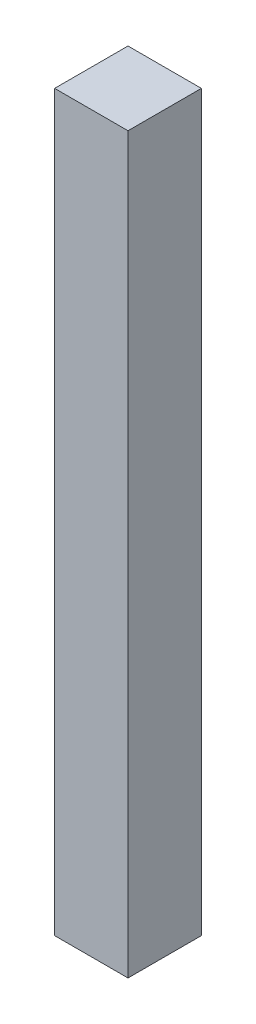
ISO-10303-21;
HEADER;
FILE_DESCRIPTION(('STEP AP214'),'2;1');
FILE_NAME('part.step','',(''),(''),'','','');
FILE_SCHEMA(('AUTOMOTIVE_DESIGN { 1 0 10303 214 1 1 1 1 }'));
ENDSEC;
DATA;
#1=APPLICATION_CONTEXT('core data for automotive mechanical design processes');
#2=APPLICATION_PROTOCOL_DEFINITION('international standard','automotive_design',2000,#1);
#3=PRODUCT_CONTEXT('',#1,'mechanical');
#4=PRODUCT('Part','Part','',(#3));
#5=PRODUCT_RELATED_PRODUCT_CATEGORY('part','',(#4));
#6=PRODUCT_DEFINITION_FORMATION('','',#4);
#7=PRODUCT_DEFINITION_CONTEXT('part definition',#1,'design');
#8=PRODUCT_DEFINITION('design','',#6,#7);
#9=PRODUCT_DEFINITION_SHAPE('','',#8);
#10=(LENGTH_UNIT() NAMED_UNIT(*) SI_UNIT(.MILLI.,.METRE.));
#11=(NAMED_UNIT(*) PLANE_ANGLE_UNIT() SI_UNIT($,.RADIAN.));
#12=(NAMED_UNIT(*) SI_UNIT($,.STERADIAN.) SOLID_ANGLE_UNIT());
#13=UNCERTAINTY_MEASURE_WITH_UNIT(LENGTH_MEASURE(1.E-05),#10,'distance_accuracy_value','');
#14=(GEOMETRIC_REPRESENTATION_CONTEXT(3) GLOBAL_UNCERTAINTY_ASSIGNED_CONTEXT((#13)) GLOBAL_UNIT_ASSIGNED_CONTEXT((#10,
#11,#12)) REPRESENTATION_CONTEXT('',''));
#15=CARTESIAN_POINT('',(0.,0.,0.));
#16=DIRECTION('',(0.,0.,1.));
#17=DIRECTION('',(1.,0.,0.));
#18=AXIS2_PLACEMENT_3D('',#15,#16,#17);
#19=CARTESIAN_POINT('',(3.175,63.5,3.175));
#20=DIRECTION('',(-1.,0.,0.));
#21=DIRECTION('',(0.,0.,1.));
#22=AXIS2_PLACEMENT_3D('',#19,#20,#21);
#23=PLANE('',#22);
#24=DIRECTION('',(0.,0.,-1.));
#25=VECTOR('',#24,1.);
#26=CARTESIAN_POINT('',(3.175,0.,3.175));
#27=LINE('',#26,#25);
#28=CARTESIAN_POINT('',(3.175,0.,3.175));
#29=VERTEX_POINT('',#28);
#30=CARTESIAN_POINT('',(3.175,0.,-3.175));
#31=VERTEX_POINT('',#30);
#32=EDGE_CURVE('E99',#29,#31,#27,.T.);
#33=ORIENTED_EDGE('',*,*,#32,.T.);
#34=DIRECTION('',(0.,-1.,0.));
#35=VECTOR('',#34,1.);
#36=CARTESIAN_POINT('',(3.175,63.5,-3.175));
#37=LINE('',#36,#35);
#38=CARTESIAN_POINT('',(3.175,63.5,-3.175));
#39=VERTEX_POINT('',#38);
#40=EDGE_CURVE('E11',#39,#31,#37,.T.);
#41=ORIENTED_EDGE('',*,*,#40,.F.);
#42=DIRECTION('',(0.,0.,-1.));
#43=VECTOR('',#42,1.);
#44=CARTESIAN_POINT('',(3.175,63.5,3.175));
#45=LINE('',#44,#43);
#46=CARTESIAN_POINT('',(3.175,63.5,3.175));
#47=VERTEX_POINT('',#46);
#48=EDGE_CURVE('E87',#47,#39,#45,.T.);
#49=ORIENTED_EDGE('',*,*,#48,.F.);
#50=DIRECTION('',(0.,-1.,0.));
#51=VECTOR('',#50,1.);
#52=CARTESIAN_POINT('',(3.175,63.5,3.175));
#53=LINE('',#52,#51);
#54=EDGE_CURVE('E95',#47,#29,#53,.T.);
#55=ORIENTED_EDGE('',*,*,#54,.T.);
#56=EDGE_LOOP('',(#33,#41,#49,#55));
#57=FACE_BOUND('',#56,.T.);
#58=ADVANCED_FACE('F36',(#57),#23,.F.);
#59=CARTESIAN_POINT('',(-3.175,63.5,-3.175));
#60=DIRECTION('',(0.,0.,1.));
#61=DIRECTION('',(1.,0.,0.));
#62=AXIS2_PLACEMENT_3D('',#59,#60,#61);
#63=PLANE('',#62);
#64=DIRECTION('',(-1.,0.,0.));
#65=VECTOR('',#64,1.);
#66=CARTESIAN_POINT('',(-3.175,0.,-3.175));
#67=LINE('',#66,#65);
#68=CARTESIAN_POINT('',(-3.175,0.,-3.175));
#69=VERTEX_POINT('',#68);
#70=EDGE_CURVE('E91',#31,#69,#67,.T.);
#71=ORIENTED_EDGE('',*,*,#70,.T.);
#72=DIRECTION('',(0.,-1.,0.));
#73=VECTOR('',#72,1.);
#74=CARTESIAN_POINT('',(-3.175,63.5,-3.175));
#75=LINE('',#74,#73);
#76=CARTESIAN_POINT('',(-3.175,63.5,-3.175));
#77=VERTEX_POINT('',#76);
#78=EDGE_CURVE('E44',#77,#69,#75,.T.);
#79=ORIENTED_EDGE('',*,*,#78,.F.);
#80=DIRECTION('',(-1.,0.,0.));
#81=VECTOR('',#80,1.);
#82=CARTESIAN_POINT('',(-3.175,63.5,-3.175));
#83=LINE('',#82,#81);
#84=EDGE_CURVE('E82',#39,#77,#83,.T.);
#85=ORIENTED_EDGE('',*,*,#84,.F.);
#86=ORIENTED_EDGE('',*,*,#40,.T.);
#87=EDGE_LOOP('',(#71,#79,#85,#86));
#88=FACE_BOUND('',#87,.T.);
#89=ADVANCED_FACE('F90',(#88),#63,.F.);
#90=CARTESIAN_POINT('',(-3.175,63.5,3.175));
#91=DIRECTION('',(1.,0.,0.));
#92=DIRECTION('',(0.,0.,-1.));
#93=AXIS2_PLACEMENT_3D('',#90,#91,#92);
#94=PLANE('',#93);
#95=DIRECTION('',(0.,0.,1.));
#96=VECTOR('',#95,1.);
#97=CARTESIAN_POINT('',(-3.175,0.,3.175));
#98=LINE('',#97,#96);
#99=CARTESIAN_POINT('',(-3.175,0.,3.175));
#100=VERTEX_POINT('',#99);
#101=EDGE_CURVE('E69',#69,#100,#98,.T.);
#102=ORIENTED_EDGE('',*,*,#101,.T.);
#103=DIRECTION('',(0.,-1.,0.));
#104=VECTOR('',#103,1.);
#105=CARTESIAN_POINT('',(-3.175,63.5,3.175));
#106=LINE('',#105,#104);
#107=CARTESIAN_POINT('',(-3.175,63.5,3.175));
#108=VERTEX_POINT('',#107);
#109=EDGE_CURVE('E92',#108,#100,#106,.T.);
#110=ORIENTED_EDGE('',*,*,#109,.F.);
#111=DIRECTION('',(0.,0.,1.));
#112=VECTOR('',#111,1.);
#113=CARTESIAN_POINT('',(-3.175,63.5,3.175));
#114=LINE('',#113,#112);
#115=EDGE_CURVE('E85',#77,#108,#114,.T.);
#116=ORIENTED_EDGE('',*,*,#115,.F.);
#117=ORIENTED_EDGE('',*,*,#78,.T.);
#118=EDGE_LOOP('',(#102,#110,#116,#117));
#119=FACE_BOUND('',#118,.T.);
#120=ADVANCED_FACE('F93',(#119),#94,.F.);
#121=CARTESIAN_POINT('',(-3.175,63.5,3.175));
#122=DIRECTION('',(0.,0.,-1.));
#123=DIRECTION('',(-1.,0.,0.));
#124=AXIS2_PLACEMENT_3D('',#121,#122,#123);
#125=PLANE('',#124);
#126=DIRECTION('',(1.,0.,0.));
#127=VECTOR('',#126,1.);
#128=CARTESIAN_POINT('',(-3.175,0.,3.175));
#129=LINE('',#128,#127);
#130=EDGE_CURVE('E75',#100,#29,#129,.T.);
#131=ORIENTED_EDGE('',*,*,#130,.T.);
#132=ORIENTED_EDGE('',*,*,#54,.F.);
#133=DIRECTION('',(1.,0.,0.));
#134=VECTOR('',#133,1.);
#135=CARTESIAN_POINT('',(-3.175,63.5,3.175));
#136=LINE('',#135,#134);
#137=EDGE_CURVE('E52',#108,#47,#136,.T.);
#138=ORIENTED_EDGE('',*,*,#137,.F.);
#139=ORIENTED_EDGE('',*,*,#109,.T.);
#140=EDGE_LOOP('',(#131,#132,#138,#139));
#141=FACE_BOUND('',#140,.T.);
#142=ADVANCED_FACE('F106',(#141),#125,.F.);
#143=CARTESIAN_POINT('',(0.,63.5,0.));
#144=DIRECTION('',(0.,-1.,0.));
#145=DIRECTION('',(0.,0.,-1.));
#146=AXIS2_PLACEMENT_3D('',#143,#144,#145);
#147=PLANE('',#146);
#148=ORIENTED_EDGE('',*,*,#48,.T.);
#149=ORIENTED_EDGE('',*,*,#84,.T.);
#150=ORIENTED_EDGE('',*,*,#115,.T.);
#151=ORIENTED_EDGE('',*,*,#137,.T.);
#152=EDGE_LOOP('',(#148,#149,#150,#151));
#153=FACE_BOUND('',#152,.T.);
#154=ADVANCED_FACE('F83',(#153),#147,.F.);
#155=CARTESIAN_POINT('',(0.,0.,0.));
#156=DIRECTION('',(0.,-1.,0.));
#157=DIRECTION('',(0.,0.,-1.));
#158=AXIS2_PLACEMENT_3D('',#155,#156,#157);
#159=PLANE('',#158);
#160=ORIENTED_EDGE('',*,*,#32,.F.);
#161=ORIENTED_EDGE('',*,*,#130,.F.);
#162=ORIENTED_EDGE('',*,*,#101,.F.);
#163=ORIENTED_EDGE('',*,*,#70,.F.);
#164=EDGE_LOOP('',(#160,#161,#162,#163));
#165=FACE_BOUND('',#164,.T.);
#166=ADVANCED_FACE('F109',(#165),#159,.T.);
#167=CLOSED_SHELL('',(#58,#89,#120,#142,#154,#166));
#168=MANIFOLD_SOLID_BREP('B2',#167);
#169=ADVANCED_BREP_SHAPE_REPRESENTATION('',(#18,#168),#14);
#170=SHAPE_DEFINITION_REPRESENTATION(#9,#169);
ENDSEC;
END-ISO-10303-21;
